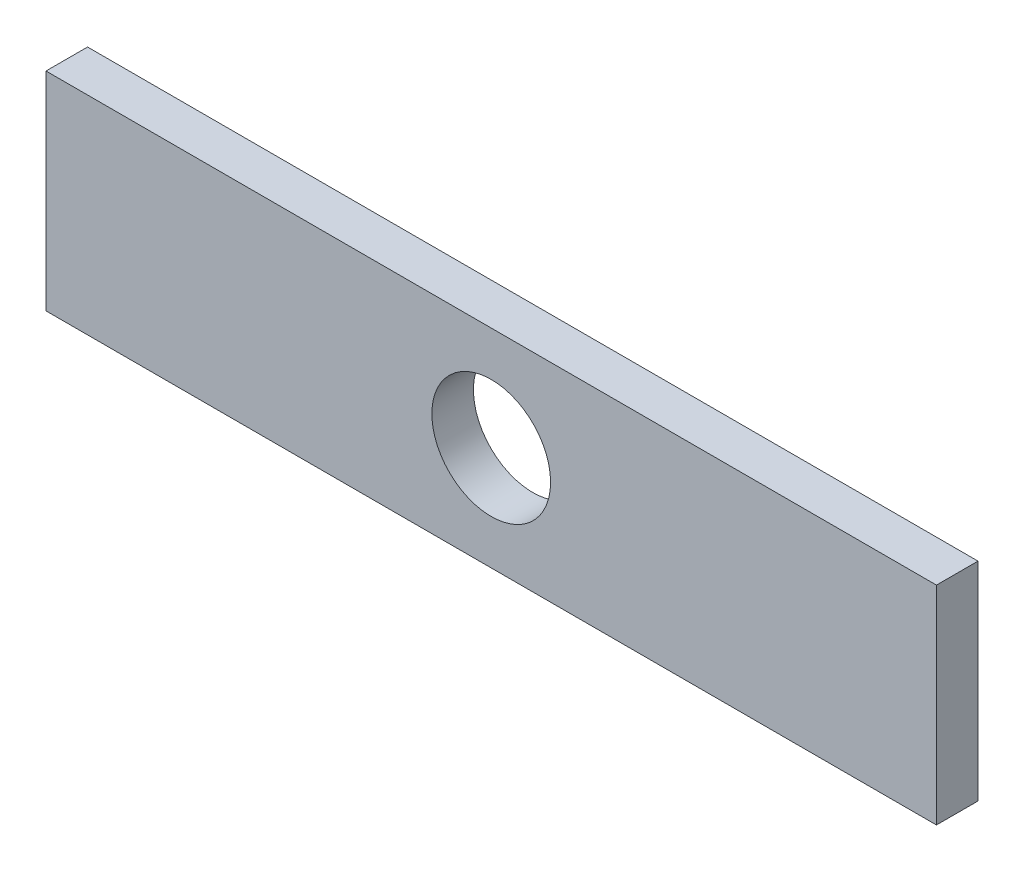
ISO-10303-21;
HEADER;
FILE_DESCRIPTION(('STEP AP214'),'2;1');
FILE_NAME('part.step','',(''),(''),'','','');
FILE_SCHEMA(('AUTOMOTIVE_DESIGN { 1 0 10303 214 1 1 1 1 }'));
ENDSEC;
DATA;
#1=APPLICATION_CONTEXT('core data for automotive mechanical design processes');
#2=APPLICATION_PROTOCOL_DEFINITION('international standard','automotive_design',2000,#1);
#3=PRODUCT_CONTEXT('',#1,'mechanical');
#4=PRODUCT('Part','Part','',(#3));
#5=PRODUCT_RELATED_PRODUCT_CATEGORY('part','',(#4));
#6=PRODUCT_DEFINITION_FORMATION('','',#4);
#7=PRODUCT_DEFINITION_CONTEXT('part definition',#1,'design');
#8=PRODUCT_DEFINITION('design','',#6,#7);
#9=PRODUCT_DEFINITION_SHAPE('','',#8);
#10=(LENGTH_UNIT() NAMED_UNIT(*) SI_UNIT(.MILLI.,.METRE.));
#11=(NAMED_UNIT(*) PLANE_ANGLE_UNIT() SI_UNIT($,.RADIAN.));
#12=(NAMED_UNIT(*) SI_UNIT($,.STERADIAN.) SOLID_ANGLE_UNIT());
#13=UNCERTAINTY_MEASURE_WITH_UNIT(LENGTH_MEASURE(1.E-05),#10,'distance_accuracy_value','');
#14=(GEOMETRIC_REPRESENTATION_CONTEXT(3) GLOBAL_UNCERTAINTY_ASSIGNED_CONTEXT((#13)) GLOBAL_UNIT_ASSIGNED_CONTEXT((#10,
#11,#12)) REPRESENTATION_CONTEXT('',''));
#15=CARTESIAN_POINT('',(0.,0.,0.));
#16=DIRECTION('',(0.,0.,1.));
#17=DIRECTION('',(1.,0.,0.));
#18=AXIS2_PLACEMENT_3D('',#15,#16,#17);
#19=CARTESIAN_POINT('',(0.,-7.,4.47492519807293));
#20=DIRECTION('',(0.,1.,0.));
#21=DIRECTION('',(0.,0.,1.));
#22=AXIS2_PLACEMENT_3D('',#19,#20,#21);
#23=PLANE('',#22);
#24=DIRECTION('',(1.,0.,0.));
#25=VECTOR('',#24,1.);
#26=CARTESIAN_POINT('',(0.,-7.,1.67492519807293));
#27=LINE('',#26,#25);
#28=CARTESIAN_POINT('',(-30.,-7.,1.67492519807293));
#29=VERTEX_POINT('',#28);
#30=CARTESIAN_POINT('',(30.,-7.,1.67492519807293));
#31=VERTEX_POINT('',#30);
#32=EDGE_CURVE('E117',#29,#31,#27,.T.);
#33=ORIENTED_EDGE('',*,*,#32,.T.);
#34=DIRECTION('',(0.,0.,-1.));
#35=VECTOR('',#34,1.);
#36=CARTESIAN_POINT('',(30.,-7.,4.47492519807293));
#37=LINE('',#36,#35);
#38=CARTESIAN_POINT('',(30.,-7.,4.47492519807293));
#39=VERTEX_POINT('',#38);
#40=EDGE_CURVE('E11',#39,#31,#37,.T.);
#41=ORIENTED_EDGE('',*,*,#40,.F.);
#42=DIRECTION('',(1.,0.,0.));
#43=VECTOR('',#42,1.);
#44=CARTESIAN_POINT('',(0.,-7.,4.47492519807293));
#45=LINE('',#44,#43);
#46=CARTESIAN_POINT('',(-30.,-7.,4.47492519807293));
#47=VERTEX_POINT('',#46);
#48=EDGE_CURVE('E95',#47,#39,#45,.T.);
#49=ORIENTED_EDGE('',*,*,#48,.F.);
#50=DIRECTION('',(0.,0.,-1.));
#51=VECTOR('',#50,1.);
#52=CARTESIAN_POINT('',(-30.,-7.,4.47492519807293));
#53=LINE('',#52,#51);
#54=EDGE_CURVE('E62',#47,#29,#53,.T.);
#55=ORIENTED_EDGE('',*,*,#54,.T.);
#56=EDGE_LOOP('',(#33,#41,#49,#55));
#57=FACE_BOUND('',#56,.T.);
#58=ADVANCED_FACE('F44',(#57),#23,.F.);
#59=CARTESIAN_POINT('',(30.,0.,4.47492519807293));
#60=DIRECTION('',(-1.,0.,0.));
#61=DIRECTION('',(0.,0.,1.));
#62=AXIS2_PLACEMENT_3D('',#59,#60,#61);
#63=PLANE('',#62);
#64=DIRECTION('',(0.,1.,0.));
#65=VECTOR('',#64,1.);
#66=CARTESIAN_POINT('',(30.,0.,1.67492519807293));
#67=LINE('',#66,#65);
#68=CARTESIAN_POINT('',(30.,7.,1.67492519807293));
#69=VERTEX_POINT('',#68);
#70=EDGE_CURVE('E101',#31,#69,#67,.T.);
#71=ORIENTED_EDGE('',*,*,#70,.T.);
#72=DIRECTION('',(0.,0.,-1.));
#73=VECTOR('',#72,1.);
#74=CARTESIAN_POINT('',(30.,7.,4.47492519807293));
#75=LINE('',#74,#73);
#76=CARTESIAN_POINT('',(30.,7.,4.47492519807293));
#77=VERTEX_POINT('',#76);
#78=EDGE_CURVE('E54',#77,#69,#75,.T.);
#79=ORIENTED_EDGE('',*,*,#78,.F.);
#80=DIRECTION('',(0.,1.,0.));
#81=VECTOR('',#80,1.);
#82=CARTESIAN_POINT('',(30.,0.,4.47492519807293));
#83=LINE('',#82,#81);
#84=EDGE_CURVE('E87',#39,#77,#83,.T.);
#85=ORIENTED_EDGE('',*,*,#84,.F.);
#86=ORIENTED_EDGE('',*,*,#40,.T.);
#87=EDGE_LOOP('',(#71,#79,#85,#86));
#88=FACE_BOUND('',#87,.T.);
#89=ADVANCED_FACE('F100',(#88),#63,.F.);
#90=CARTESIAN_POINT('',(0.,7.,4.47492519807293));
#91=DIRECTION('',(0.,1.,0.));
#92=DIRECTION('',(0.,0.,1.));
#93=AXIS2_PLACEMENT_3D('',#90,#91,#92);
#94=PLANE('',#93);
#95=DIRECTION('',(1.,0.,0.));
#96=VECTOR('',#95,1.);
#97=CARTESIAN_POINT('',(0.,7.,1.67492519807293));
#98=LINE('',#97,#96);
#99=CARTESIAN_POINT('',(-30.,7.,1.67492519807293));
#100=VERTEX_POINT('',#99);
#101=EDGE_CURVE('E123',#100,#69,#98,.T.);
#102=ORIENTED_EDGE('',*,*,#101,.F.);
#103=DIRECTION('',(0.,0.,-1.));
#104=VECTOR('',#103,1.);
#105=CARTESIAN_POINT('',(-30.,7.,4.47492519807293));
#106=LINE('',#105,#104);
#107=CARTESIAN_POINT('',(-30.,7.,4.47492519807293));
#108=VERTEX_POINT('',#107);
#109=EDGE_CURVE('E76',#108,#100,#106,.T.);
#110=ORIENTED_EDGE('',*,*,#109,.F.);
#111=DIRECTION('',(1.,0.,0.));
#112=VECTOR('',#111,1.);
#113=CARTESIAN_POINT('',(0.,7.,4.47492519807293));
#114=LINE('',#113,#112);
#115=EDGE_CURVE('E94',#108,#77,#114,.T.);
#116=ORIENTED_EDGE('',*,*,#115,.T.);
#117=ORIENTED_EDGE('',*,*,#78,.T.);
#118=EDGE_LOOP('',(#102,#110,#116,#117));
#119=FACE_BOUND('',#118,.T.);
#120=ADVANCED_FACE('F105',(#119),#94,.T.);
#121=CARTESIAN_POINT('',(0.,0.,4.47492519807293));
#122=DIRECTION('',(0.,0.,-1.));
#123=DIRECTION('',(-1.,0.,0.));
#124=AXIS2_PLACEMENT_3D('',#121,#122,#123);
#125=CYLINDRICAL_SURFACE('',#124,4.);
#126=CARTESIAN_POINT('',(0.,0.,4.47492519807293));
#127=DIRECTION('',(0.,0.,1.));
#128=DIRECTION('',(1.,0.,0.));
#129=AXIS2_PLACEMENT_3D('',#126,#127,#128);
#130=CIRCLE('',#129,4.);
#131=CARTESIAN_POINT('',(3.99999999999999,0.,4.47492519807293));
#132=VERTEX_POINT('',#131);
#133=EDGE_CURVE('E130',#132,#132,#130,.T.);
#134=ORIENTED_EDGE('',*,*,#133,.T.);
#135=EDGE_LOOP('',(#134));
#136=FACE_BOUND('',#135,.T.);
#137=CARTESIAN_POINT('',(0.,0.,1.67492519807293));
#138=DIRECTION('',(0.,0.,1.));
#139=DIRECTION('',(1.,0.,0.));
#140=AXIS2_PLACEMENT_3D('',#137,#138,#139);
#141=CIRCLE('',#140,4.);
#142=CARTESIAN_POINT('',(3.99999999999999,0.,1.67492519807293));
#143=VERTEX_POINT('',#142);
#144=EDGE_CURVE('E113',#143,#143,#141,.T.);
#145=ORIENTED_EDGE('',*,*,#144,.F.);
#146=EDGE_LOOP('',(#145));
#147=FACE_BOUND('',#146,.T.);
#148=ADVANCED_FACE('F46',(#136,#147),#125,.F.);
#149=CARTESIAN_POINT('',(-30.,0.,4.47492519807293));
#150=DIRECTION('',(-1.,0.,0.));
#151=DIRECTION('',(0.,0.,1.));
#152=AXIS2_PLACEMENT_3D('',#149,#150,#151);
#153=PLANE('',#152);
#154=DIRECTION('',(0.,1.,0.));
#155=VECTOR('',#154,1.);
#156=CARTESIAN_POINT('',(-30.,0.,1.67492519807293));
#157=LINE('',#156,#155);
#158=EDGE_CURVE('E126',#29,#100,#157,.T.);
#159=ORIENTED_EDGE('',*,*,#158,.F.);
#160=ORIENTED_EDGE('',*,*,#54,.F.);
#161=DIRECTION('',(0.,1.,0.));
#162=VECTOR('',#161,1.);
#163=CARTESIAN_POINT('',(-30.,0.,4.47492519807293));
#164=LINE('',#163,#162);
#165=EDGE_CURVE('E107',#47,#108,#164,.T.);
#166=ORIENTED_EDGE('',*,*,#165,.T.);
#167=ORIENTED_EDGE('',*,*,#109,.T.);
#168=EDGE_LOOP('',(#159,#160,#166,#167));
#169=FACE_BOUND('',#168,.T.);
#170=ADVANCED_FACE('F193',(#169),#153,.T.);
#171=CARTESIAN_POINT('',(0.,0.,4.47492519807293));
#172=DIRECTION('',(0.,0.,1.));
#173=DIRECTION('',(1.,0.,0.));
#174=AXIS2_PLACEMENT_3D('',#171,#172,#173);
#175=PLANE('',#174);
#176=ORIENTED_EDGE('',*,*,#133,.F.);
#177=EDGE_LOOP('',(#176));
#178=FACE_BOUND('',#177,.T.);
#179=ORIENTED_EDGE('',*,*,#48,.T.);
#180=ORIENTED_EDGE('',*,*,#84,.T.);
#181=ORIENTED_EDGE('',*,*,#115,.F.);
#182=ORIENTED_EDGE('',*,*,#165,.F.);
#183=EDGE_LOOP('',(#179,#180,#181,#182));
#184=FACE_BOUND('',#183,.T.);
#185=ADVANCED_FACE('F91',(#178,#184),#175,.T.);
#186=CARTESIAN_POINT('',(0.,0.,1.67492519807293));
#187=DIRECTION('',(0.,0.,1.));
#188=DIRECTION('',(1.,0.,0.));
#189=AXIS2_PLACEMENT_3D('',#186,#187,#188);
#190=PLANE('',#189);
#191=CARTESIAN_POINT('',(-24.,0.,1.67492519807293));
#192=DIRECTION('',(0.,0.,1.));
#193=DIRECTION('',(1.,0.,0.));
#194=AXIS2_PLACEMENT_3D('',#191,#192,#193);
#195=CIRCLE('',#194,2.);
#196=CARTESIAN_POINT('',(-22.,0.,1.67492519807293));
#197=VERTEX_POINT('',#196);
#198=EDGE_CURVE('E166',#197,#197,#195,.T.);
#199=ORIENTED_EDGE('',*,*,#198,.T.);
#200=EDGE_LOOP('',(#199));
#201=FACE_BOUND('',#200,.T.);
#202=CARTESIAN_POINT('',(-14.,0.,1.67492519807293));
#203=DIRECTION('',(0.,0.,1.));
#204=DIRECTION('',(1.,0.,0.));
#205=AXIS2_PLACEMENT_3D('',#202,#203,#204);
#206=CIRCLE('',#205,2.);
#207=CARTESIAN_POINT('',(-12.,0.,1.67492519807293));
#208=VERTEX_POINT('',#207);
#209=EDGE_CURVE('E158',#208,#208,#206,.T.);
#210=ORIENTED_EDGE('',*,*,#209,.T.);
#211=EDGE_LOOP('',(#210));
#212=FACE_BOUND('',#211,.T.);
#213=CARTESIAN_POINT('',(14.,0.,1.67492519807293));
#214=DIRECTION('',(0.,0.,1.));
#215=DIRECTION('',(1.,0.,0.));
#216=AXIS2_PLACEMENT_3D('',#213,#214,#215);
#217=CIRCLE('',#216,2.);
#218=CARTESIAN_POINT('',(16.,0.,1.67492519807293));
#219=VERTEX_POINT('',#218);
#220=EDGE_CURVE('E150',#219,#219,#217,.T.);
#221=ORIENTED_EDGE('',*,*,#220,.T.);
#222=EDGE_LOOP('',(#221));
#223=FACE_BOUND('',#222,.T.);
#224=CARTESIAN_POINT('',(24.,0.,1.67492519807293));
#225=DIRECTION('',(0.,0.,1.));
#226=DIRECTION('',(1.,0.,0.));
#227=AXIS2_PLACEMENT_3D('',#224,#225,#226);
#228=CIRCLE('',#227,2.);
#229=CARTESIAN_POINT('',(26.,0.,1.67492519807293));
#230=VERTEX_POINT('',#229);
#231=EDGE_CURVE('E142',#230,#230,#228,.T.);
#232=ORIENTED_EDGE('',*,*,#231,.T.);
#233=EDGE_LOOP('',(#232));
#234=FACE_BOUND('',#233,.T.);
#235=ORIENTED_EDGE('',*,*,#144,.T.);
#236=EDGE_LOOP('',(#235));
#237=FACE_BOUND('',#236,.T.);
#238=ORIENTED_EDGE('',*,*,#32,.F.);
#239=ORIENTED_EDGE('',*,*,#158,.T.);
#240=ORIENTED_EDGE('',*,*,#101,.T.);
#241=ORIENTED_EDGE('',*,*,#70,.F.);
#242=EDGE_LOOP('',(#238,#239,#240,#241));
#243=FACE_BOUND('',#242,.T.);
#244=ADVANCED_FACE('F196',(#201,#212,#223,#234,#237,#243),#190,.F.);
#245=CARTESIAN_POINT('',(24.,0.,-2.32507480192707));
#246=DIRECTION('',(0.,0.,1.));
#247=DIRECTION('',(1.,0.,0.));
#248=AXIS2_PLACEMENT_3D('',#245,#246,#247);
#249=CYLINDRICAL_SURFACE('',#248,2.);
#250=CARTESIAN_POINT('',(24.,0.,-2.32507480192707));
#251=DIRECTION('',(0.,0.,1.));
#252=DIRECTION('',(1.,0.,0.));
#253=AXIS2_PLACEMENT_3D('',#250,#251,#252);
#254=CIRCLE('',#253,2.);
#255=CARTESIAN_POINT('',(26.,0.,-2.32507480192707));
#256=VERTEX_POINT('',#255);
#257=EDGE_CURVE('E118',#256,#256,#254,.T.);
#258=ORIENTED_EDGE('',*,*,#257,.T.);
#259=EDGE_LOOP('',(#258));
#260=FACE_BOUND('',#259,.T.);
#261=ORIENTED_EDGE('',*,*,#231,.F.);
#262=EDGE_LOOP('',(#261));
#263=FACE_BOUND('',#262,.T.);
#264=ADVANCED_FACE('F199',(#260,#263),#249,.T.);
#265=CARTESIAN_POINT('',(0.,0.,-2.32507480192707));
#266=DIRECTION('',(0.,0.,1.));
#267=DIRECTION('',(1.,0.,0.));
#268=AXIS2_PLACEMENT_3D('',#265,#266,#267);
#269=PLANE('',#268);
#270=ORIENTED_EDGE('',*,*,#257,.F.);
#271=EDGE_LOOP('',(#270));
#272=FACE_BOUND('',#271,.T.);
#273=ADVANCED_FACE('F206',(#272),#269,.F.);
#274=CARTESIAN_POINT('',(14.,0.,-2.32507480192707));
#275=DIRECTION('',(0.,0.,1.));
#276=DIRECTION('',(1.,0.,0.));
#277=AXIS2_PLACEMENT_3D('',#274,#275,#276);
#278=CYLINDRICAL_SURFACE('',#277,2.);
#279=CARTESIAN_POINT('',(14.,0.,-2.32507480192707));
#280=DIRECTION('',(0.,0.,1.));
#281=DIRECTION('',(1.,0.,0.));
#282=AXIS2_PLACEMENT_3D('',#279,#280,#281);
#283=CIRCLE('',#282,2.);
#284=CARTESIAN_POINT('',(16.,0.,-2.32507480192707));
#285=VERTEX_POINT('',#284);
#286=EDGE_CURVE('E146',#285,#285,#283,.T.);
#287=ORIENTED_EDGE('',*,*,#286,.T.);
#288=EDGE_LOOP('',(#287));
#289=FACE_BOUND('',#288,.T.);
#290=ORIENTED_EDGE('',*,*,#220,.F.);
#291=EDGE_LOOP('',(#290));
#292=FACE_BOUND('',#291,.T.);
#293=ADVANCED_FACE('F210',(#289,#292),#278,.T.);
#294=CARTESIAN_POINT('',(0.,0.,-2.32507480192707));
#295=DIRECTION('',(0.,0.,1.));
#296=DIRECTION('',(1.,0.,0.));
#297=AXIS2_PLACEMENT_3D('',#294,#295,#296);
#298=PLANE('',#297);
#299=ORIENTED_EDGE('',*,*,#286,.F.);
#300=EDGE_LOOP('',(#299));
#301=FACE_BOUND('',#300,.T.);
#302=ADVANCED_FACE('F214',(#301),#298,.F.);
#303=CARTESIAN_POINT('',(-14.,0.,-2.32507480192707));
#304=DIRECTION('',(0.,0.,1.));
#305=DIRECTION('',(1.,0.,0.));
#306=AXIS2_PLACEMENT_3D('',#303,#304,#305);
#307=CYLINDRICAL_SURFACE('',#306,2.);
#308=CARTESIAN_POINT('',(-14.,0.,-2.32507480192707));
#309=DIRECTION('',(0.,0.,1.));
#310=DIRECTION('',(1.,0.,0.));
#311=AXIS2_PLACEMENT_3D('',#308,#309,#310);
#312=CIRCLE('',#311,2.);
#313=CARTESIAN_POINT('',(-12.,0.,-2.32507480192707));
#314=VERTEX_POINT('',#313);
#315=EDGE_CURVE('E154',#314,#314,#312,.T.);
#316=ORIENTED_EDGE('',*,*,#315,.T.);
#317=EDGE_LOOP('',(#316));
#318=FACE_BOUND('',#317,.T.);
#319=ORIENTED_EDGE('',*,*,#209,.F.);
#320=EDGE_LOOP('',(#319));
#321=FACE_BOUND('',#320,.T.);
#322=ADVANCED_FACE('F218',(#318,#321),#307,.T.);
#323=CARTESIAN_POINT('',(0.,0.,-2.32507480192707));
#324=DIRECTION('',(0.,0.,1.));
#325=DIRECTION('',(1.,0.,0.));
#326=AXIS2_PLACEMENT_3D('',#323,#324,#325);
#327=PLANE('',#326);
#328=ORIENTED_EDGE('',*,*,#315,.F.);
#329=EDGE_LOOP('',(#328));
#330=FACE_BOUND('',#329,.T.);
#331=ADVANCED_FACE('F183',(#330),#327,.F.);
#332=CARTESIAN_POINT('',(-24.,0.,-2.32507480192707));
#333=DIRECTION('',(0.,0.,1.));
#334=DIRECTION('',(1.,0.,0.));
#335=AXIS2_PLACEMENT_3D('',#332,#333,#334);
#336=CYLINDRICAL_SURFACE('',#335,2.);
#337=CARTESIAN_POINT('',(-24.,0.,-2.32507480192707));
#338=DIRECTION('',(0.,0.,1.));
#339=DIRECTION('',(1.,0.,0.));
#340=AXIS2_PLACEMENT_3D('',#337,#338,#339);
#341=CIRCLE('',#340,2.);
#342=CARTESIAN_POINT('',(-22.,0.,-2.32507480192707));
#343=VERTEX_POINT('',#342);
#344=EDGE_CURVE('E162',#343,#343,#341,.T.);
#345=ORIENTED_EDGE('',*,*,#344,.T.);
#346=EDGE_LOOP('',(#345));
#347=FACE_BOUND('',#346,.T.);
#348=ORIENTED_EDGE('',*,*,#198,.F.);
#349=EDGE_LOOP('',(#348));
#350=FACE_BOUND('',#349,.T.);
#351=ADVANCED_FACE('F174',(#347,#350),#336,.T.);
#352=CARTESIAN_POINT('',(0.,0.,-2.32507480192707));
#353=DIRECTION('',(0.,0.,1.));
#354=DIRECTION('',(1.,0.,0.));
#355=AXIS2_PLACEMENT_3D('',#352,#353,#354);
#356=PLANE('',#355);
#357=ORIENTED_EDGE('',*,*,#344,.F.);
#358=EDGE_LOOP('',(#357));
#359=FACE_BOUND('',#358,.T.);
#360=ADVANCED_FACE('F177',(#359),#356,.F.);
#361=CLOSED_SHELL('',(#58,#89,#120,#148,#170,#185,#244,#264,#273,#293,#302,#322,#331,#351,#360));
#362=MANIFOLD_SOLID_BREP('B2',#361);
#363=ADVANCED_BREP_SHAPE_REPRESENTATION('',(#18,#362),#14);
#364=SHAPE_DEFINITION_REPRESENTATION(#9,#363);
ENDSEC;
END-ISO-10303-21;
